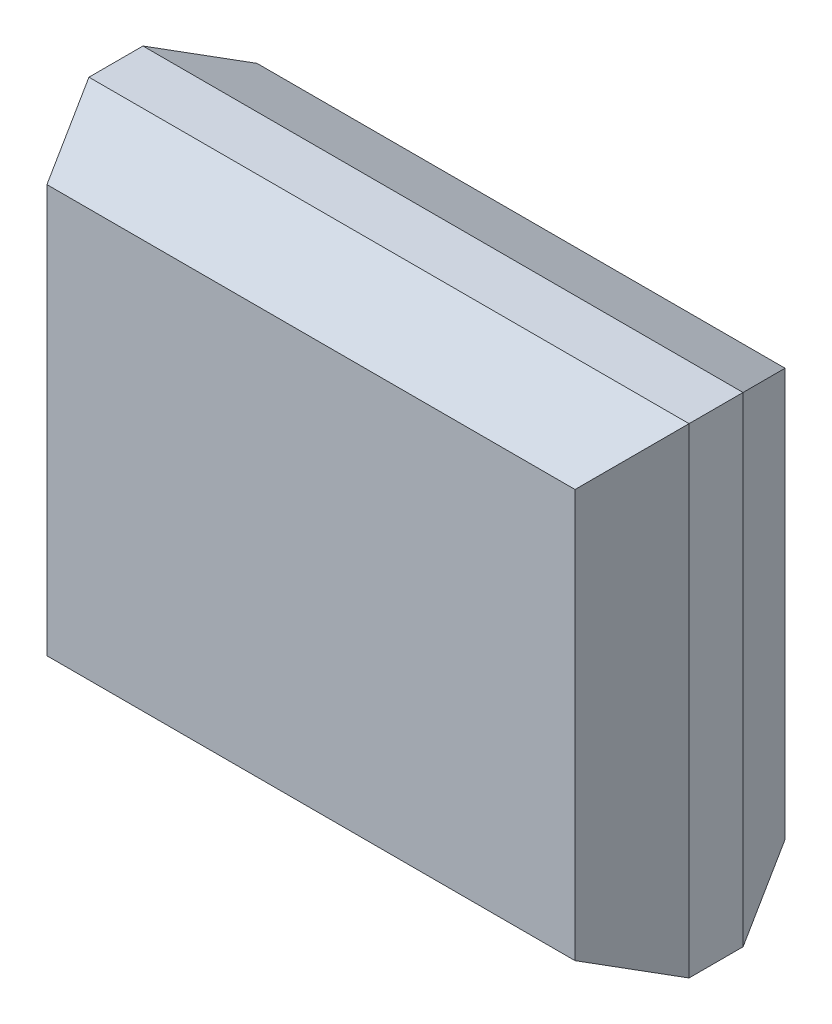
ISO-10303-21;
HEADER;
FILE_DESCRIPTION(('STEP AP214'),'2;1');
FILE_NAME('part.step','',(''),(''),'','','');
FILE_SCHEMA(('AUTOMOTIVE_DESIGN { 1 0 10303 214 1 1 1 1 }'));
ENDSEC;
DATA;
#1=APPLICATION_CONTEXT('core data for automotive mechanical design processes');
#2=APPLICATION_PROTOCOL_DEFINITION('international standard','automotive_design',2000,#1);
#3=PRODUCT_CONTEXT('',#1,'mechanical');
#4=PRODUCT('Part','Part','',(#3));
#5=PRODUCT_RELATED_PRODUCT_CATEGORY('part','',(#4));
#6=PRODUCT_DEFINITION_FORMATION('','',#4);
#7=PRODUCT_DEFINITION_CONTEXT('part definition',#1,'design');
#8=PRODUCT_DEFINITION('design','',#6,#7);
#9=PRODUCT_DEFINITION_SHAPE('','',#8);
#10=(LENGTH_UNIT() NAMED_UNIT(*) SI_UNIT(.MILLI.,.METRE.));
#11=(NAMED_UNIT(*) PLANE_ANGLE_UNIT() SI_UNIT($,.RADIAN.));
#12=(NAMED_UNIT(*) SI_UNIT($,.STERADIAN.) SOLID_ANGLE_UNIT());
#13=UNCERTAINTY_MEASURE_WITH_UNIT(LENGTH_MEASURE(1.E-05),#10,'distance_accuracy_value','');
#14=(GEOMETRIC_REPRESENTATION_CONTEXT(3) GLOBAL_UNCERTAINTY_ASSIGNED_CONTEXT((#13)) GLOBAL_UNIT_ASSIGNED_CONTEXT((#10,
#11,#12)) REPRESENTATION_CONTEXT('',''));
#15=CARTESIAN_POINT('',(0.,0.,0.));
#16=DIRECTION('',(0.,0.,1.));
#17=DIRECTION('',(1.,0.,0.));
#18=AXIS2_PLACEMENT_3D('',#15,#16,#17);
#19=CARTESIAN_POINT('',(0.,0.,1.75));
#20=DIRECTION('',(1.,0.,0.));
#21=DIRECTION('',(0.,0.,-1.));
#22=AXIS2_PLACEMENT_3D('',#19,#20,#21);
#23=PLANE('',#22);
#24=DIRECTION('',(0.,0.,-1.));
#25=VECTOR('',#24,1.);
#26=CARTESIAN_POINT('',(0.,4.,1.75));
#27=LINE('',#26,#25);
#28=CARTESIAN_POINT('',(0.,4.,1.09999999999999));
#29=VERTEX_POINT('',#28);
#30=CARTESIAN_POINT('',(0.,4.,0.650000000000007));
#31=VERTEX_POINT('',#30);
#32=EDGE_CURVE('E173',#29,#31,#27,.T.);
#33=ORIENTED_EDGE('',*,*,#32,.T.);
#34=DIRECTION('',(0.,-1.,0.));
#35=VECTOR('',#34,1.);
#36=CARTESIAN_POINT('',(0.,0.3,0.650000000000005));
#37=LINE('',#36,#35);
#38=CARTESIAN_POINT('',(0.,0.,0.650000000000007));
#39=VERTEX_POINT('',#38);
#40=EDGE_CURVE('E145',#31,#39,#37,.T.);
#41=ORIENTED_EDGE('',*,*,#40,.T.);
#42=DIRECTION('',(0.,0.,-1.));
#43=VECTOR('',#42,1.);
#44=CARTESIAN_POINT('',(0.,0.,1.75));
#45=LINE('',#44,#43);
#46=CARTESIAN_POINT('',(0.,0.,1.1));
#47=VERTEX_POINT('',#46);
#48=EDGE_CURVE('E118',#47,#39,#45,.T.);
#49=ORIENTED_EDGE('',*,*,#48,.F.);
#50=DIRECTION('',(0.,1.,0.));
#51=VECTOR('',#50,1.);
#52=CARTESIAN_POINT('',(0.,0.,1.1));
#53=LINE('',#52,#51);
#54=EDGE_CURVE('E151',#47,#29,#53,.T.);
#55=ORIENTED_EDGE('',*,*,#54,.T.);
#56=EDGE_LOOP('',(#33,#41,#49,#55));
#57=FACE_BOUND('',#56,.T.);
#58=ADVANCED_FACE('F30',(#57),#23,.F.);
#59=CARTESIAN_POINT('',(0.,0.,1.75));
#60=DIRECTION('',(0.,1.,0.));
#61=DIRECTION('',(0.,0.,1.));
#62=AXIS2_PLACEMENT_3D('',#59,#60,#61);
#63=PLANE('',#62);
#64=ORIENTED_EDGE('',*,*,#48,.T.);
#65=DIRECTION('',(1.,0.,0.));
#66=VECTOR('',#65,1.);
#67=CARTESIAN_POINT('',(5.,0.,0.650000000000005));
#68=LINE('',#67,#66);
#69=CARTESIAN_POINT('',(5.,0.,0.650000000000007));
#70=VERTEX_POINT('',#69);
#71=EDGE_CURVE('E117',#39,#70,#68,.T.);
#72=ORIENTED_EDGE('',*,*,#71,.T.);
#73=DIRECTION('',(0.,0.,-1.));
#74=VECTOR('',#73,1.);
#75=CARTESIAN_POINT('',(5.,0.,1.75));
#76=LINE('',#75,#74);
#77=CARTESIAN_POINT('',(5.,0.,1.1));
#78=VERTEX_POINT('',#77);
#79=EDGE_CURVE('E99',#78,#70,#76,.T.);
#80=ORIENTED_EDGE('',*,*,#79,.F.);
#81=DIRECTION('',(-1.,0.,0.));
#82=VECTOR('',#81,1.);
#83=CARTESIAN_POINT('',(0.,0.,1.1));
#84=LINE('',#83,#82);
#85=EDGE_CURVE('E114',#78,#47,#84,.T.);
#86=ORIENTED_EDGE('',*,*,#85,.T.);
#87=EDGE_LOOP('',(#64,#72,#80,#86));
#88=FACE_BOUND('',#87,.T.);
#89=ADVANCED_FACE('F113',(#88),#63,.F.);
#90=CARTESIAN_POINT('',(5.,0.,1.75));
#91=DIRECTION('',(-1.,0.,0.));
#92=DIRECTION('',(0.,0.,1.));
#93=AXIS2_PLACEMENT_3D('',#90,#91,#92);
#94=PLANE('',#93);
#95=ORIENTED_EDGE('',*,*,#79,.T.);
#96=DIRECTION('',(0.,1.,0.));
#97=VECTOR('',#96,1.);
#98=CARTESIAN_POINT('',(5.,3.7,0.650000000000005));
#99=LINE('',#98,#97);
#100=CARTESIAN_POINT('',(5.,4.,0.650000000000007));
#101=VERTEX_POINT('',#100);
#102=EDGE_CURVE('E131',#70,#101,#99,.T.);
#103=ORIENTED_EDGE('',*,*,#102,.T.);
#104=DIRECTION('',(0.,0.,-1.));
#105=VECTOR('',#104,1.);
#106=CARTESIAN_POINT('',(5.,4.,1.75));
#107=LINE('',#106,#105);
#108=CARTESIAN_POINT('',(5.,4.,1.09999999999999));
#109=VERTEX_POINT('',#108);
#110=EDGE_CURVE('E102',#109,#101,#107,.T.);
#111=ORIENTED_EDGE('',*,*,#110,.F.);
#112=DIRECTION('',(0.,-1.,0.));
#113=VECTOR('',#112,1.);
#114=CARTESIAN_POINT('',(5.,0.,1.09999999999999));
#115=LINE('',#114,#113);
#116=EDGE_CURVE('E95',#109,#78,#115,.T.);
#117=ORIENTED_EDGE('',*,*,#116,.T.);
#118=EDGE_LOOP('',(#95,#103,#111,#117));
#119=FACE_BOUND('',#118,.T.);
#120=ADVANCED_FACE('F97',(#119),#94,.F.);
#121=CARTESIAN_POINT('',(0.,4.,1.75));
#122=DIRECTION('',(0.,-1.,0.));
#123=DIRECTION('',(0.,0.,-1.));
#124=AXIS2_PLACEMENT_3D('',#121,#122,#123);
#125=PLANE('',#124);
#126=ORIENTED_EDGE('',*,*,#110,.T.);
#127=DIRECTION('',(-1.,0.,0.));
#128=VECTOR('',#127,1.);
#129=CARTESIAN_POINT('',(0.,4.,0.650000000000005));
#130=LINE('',#129,#128);
#131=EDGE_CURVE('E159',#101,#31,#130,.T.);
#132=ORIENTED_EDGE('',*,*,#131,.T.);
#133=ORIENTED_EDGE('',*,*,#32,.F.);
#134=DIRECTION('',(1.,0.,0.));
#135=VECTOR('',#134,1.);
#136=CARTESIAN_POINT('',(0.,4.,1.09999999999999));
#137=LINE('',#136,#135);
#138=EDGE_CURVE('E162',#29,#109,#137,.T.);
#139=ORIENTED_EDGE('',*,*,#138,.T.);
#140=EDGE_LOOP('',(#126,#132,#133,#139));
#141=FACE_BOUND('',#140,.T.);
#142=ADVANCED_FACE('F189',(#141),#125,.F.);
#143=CARTESIAN_POINT('',(0.,4.,1.75));
#144=DIRECTION('',(0.,0.,-1.));
#145=DIRECTION('',(-1.,0.,0.));
#146=AXIS2_PLACEMENT_3D('',#143,#144,#145);
#147=PLANE('',#146);
#148=DIRECTION('',(1.,0.,0.));
#149=VECTOR('',#148,1.);
#150=CARTESIAN_POINT('',(0.,0.3,1.75));
#151=LINE('',#150,#149);
#152=CARTESIAN_POINT('',(0.3,0.3,1.75));
#153=VERTEX_POINT('',#152);
#154=CARTESIAN_POINT('',(4.7,0.3,1.75));
#155=VERTEX_POINT('',#154);
#156=EDGE_CURVE('E125',#153,#155,#151,.T.);
#157=ORIENTED_EDGE('',*,*,#156,.T.);
#158=DIRECTION('',(0.,1.,0.));
#159=VECTOR('',#158,1.);
#160=CARTESIAN_POINT('',(4.7,4.,1.75));
#161=LINE('',#160,#159);
#162=CARTESIAN_POINT('',(4.7,3.7,1.75));
#163=VERTEX_POINT('',#162);
#164=EDGE_CURVE('E130',#155,#163,#161,.T.);
#165=ORIENTED_EDGE('',*,*,#164,.T.);
#166=DIRECTION('',(-1.,0.,0.));
#167=VECTOR('',#166,1.);
#168=CARTESIAN_POINT('',(0.,3.7,1.75));
#169=LINE('',#168,#167);
#170=CARTESIAN_POINT('',(0.3,3.7,1.75));
#171=VERTEX_POINT('',#170);
#172=EDGE_CURVE('E165',#163,#171,#169,.T.);
#173=ORIENTED_EDGE('',*,*,#172,.T.);
#174=DIRECTION('',(0.,-1.,0.));
#175=VECTOR('',#174,1.);
#176=CARTESIAN_POINT('',(0.3,4.,1.75));
#177=LINE('',#176,#175);
#178=EDGE_CURVE('E154',#171,#153,#177,.T.);
#179=ORIENTED_EDGE('',*,*,#178,.T.);
#180=EDGE_LOOP('',(#157,#165,#173,#179));
#181=FACE_BOUND('',#180,.T.);
#182=ADVANCED_FACE('F193',(#181),#147,.F.);
#183=CARTESIAN_POINT('',(0.,4.,0.));
#184=DIRECTION('',(0.,0.,-1.));
#185=DIRECTION('',(-1.,0.,0.));
#186=AXIS2_PLACEMENT_3D('',#183,#184,#185);
#187=PLANE('',#186);
#188=DIRECTION('',(1.,0.,0.));
#189=VECTOR('',#188,1.);
#190=CARTESIAN_POINT('',(5.,3.7,0.));
#191=LINE('',#190,#189);
#192=CARTESIAN_POINT('',(0.300000000000001,3.7,0.));
#193=VERTEX_POINT('',#192);
#194=CARTESIAN_POINT('',(4.7,3.7,0.));
#195=VERTEX_POINT('',#194);
#196=EDGE_CURVE('E157',#193,#195,#191,.T.);
#197=ORIENTED_EDGE('',*,*,#196,.T.);
#198=DIRECTION('',(0.,-1.,0.));
#199=VECTOR('',#198,1.);
#200=CARTESIAN_POINT('',(4.7,0.3,0.));
#201=LINE('',#200,#199);
#202=CARTESIAN_POINT('',(4.7,0.3,0.));
#203=VERTEX_POINT('',#202);
#204=EDGE_CURVE('E38',#195,#203,#201,.T.);
#205=ORIENTED_EDGE('',*,*,#204,.T.);
#206=DIRECTION('',(-1.,0.,0.));
#207=VECTOR('',#206,1.);
#208=CARTESIAN_POINT('',(0.,0.3,0.));
#209=LINE('',#208,#207);
#210=CARTESIAN_POINT('',(0.3,0.3,0.));
#211=VERTEX_POINT('',#210);
#212=EDGE_CURVE('E167',#203,#211,#209,.T.);
#213=ORIENTED_EDGE('',*,*,#212,.T.);
#214=DIRECTION('',(0.,1.,0.));
#215=VECTOR('',#214,1.);
#216=CARTESIAN_POINT('',(0.3,3.7,0.));
#217=LINE('',#216,#215);
#218=EDGE_CURVE('E140',#211,#193,#217,.T.);
#219=ORIENTED_EDGE('',*,*,#218,.T.);
#220=EDGE_LOOP('',(#197,#205,#213,#219));
#221=FACE_BOUND('',#220,.T.);
#222=ADVANCED_FACE('F191',(#221),#187,.T.);
#223=CARTESIAN_POINT('',(0.,0.3,1.75));
#224=DIRECTION('',(0.,0.907959384500453,-0.419058177461745));
#225=DIRECTION('',(0.,0.419058177461745,0.907959384500453));
#226=AXIS2_PLACEMENT_3D('',#223,#224,#225);
#227=PLANE('',#226);
#228=ORIENTED_EDGE('',*,*,#85,.F.);
#229=DIRECTION('',(-0.386493975840497,0.386493975840497,0.837403614321082));
#230=VECTOR('',#229,1.);
#231=CARTESIAN_POINT('',(3.99792531120332,1.00207468879667,3.27116182572614));
#232=LINE('',#231,#230);
#233=EDGE_CURVE('E105',#78,#155,#232,.T.);
#234=ORIENTED_EDGE('',*,*,#233,.T.);
#235=ORIENTED_EDGE('',*,*,#156,.F.);
#236=DIRECTION('',(-0.386493975840497,-0.386493975840497,-0.837403614321082));
#237=VECTOR('',#236,1.);
#238=CARTESIAN_POINT('',(0.255186721991702,0.255186721991702,1.65290456431535));
#239=LINE('',#238,#237);
#240=EDGE_CURVE('E124',#153,#47,#239,.T.);
#241=ORIENTED_EDGE('',*,*,#240,.T.);
#242=EDGE_LOOP('',(#228,#234,#235,#241));
#243=FACE_BOUND('',#242,.T.);
#244=ADVANCED_FACE('F121',(#243),#227,.F.);
#245=CARTESIAN_POINT('',(0.,0.,0.650000000000005));
#246=DIRECTION('',(0.,-0.907959384500453,-0.419058177461745));
#247=DIRECTION('',(0.,0.419058177461745,-0.907959384500453));
#248=AXIS2_PLACEMENT_3D('',#245,#246,#247);
#249=PLANE('',#248);
#250=ORIENTED_EDGE('',*,*,#212,.F.);
#251=DIRECTION('',(0.386493975840497,-0.386493975840497,0.837403614321082));
#252=VECTOR('',#251,1.);
#253=CARTESIAN_POINT('',(4.25311203319503,0.746887966804974,-0.968257261410782));
#254=LINE('',#253,#252);
#255=EDGE_CURVE('E11',#203,#70,#254,.T.);
#256=ORIENTED_EDGE('',*,*,#255,.T.);
#257=ORIENTED_EDGE('',*,*,#71,.F.);
#258=DIRECTION('',(0.386493975840497,0.386493975840497,-0.837403614321082));
#259=VECTOR('',#258,1.);
#260=CARTESIAN_POINT('',(0.,0.,0.650000000000005));
#261=LINE('',#260,#259);
#262=EDGE_CURVE('E142',#39,#211,#261,.T.);
#263=ORIENTED_EDGE('',*,*,#262,.T.);
#264=EDGE_LOOP('',(#250,#256,#257,#263));
#265=FACE_BOUND('',#264,.T.);
#266=ADVANCED_FACE('F186',(#265),#249,.T.);
#267=CARTESIAN_POINT('',(0.,3.7,1.75));
#268=DIRECTION('',(0.,-0.907959384500452,-0.419058177461745));
#269=DIRECTION('',(0.,0.419058177461745,-0.907959384500453));
#270=AXIS2_PLACEMENT_3D('',#267,#268,#269);
#271=PLANE('',#270);
#272=ORIENTED_EDGE('',*,*,#172,.F.);
#273=DIRECTION('',(0.386493975840497,0.386493975840497,-0.837403614321082));
#274=VECTOR('',#273,1.);
#275=CARTESIAN_POINT('',(3.99792531120332,2.99792531120332,3.27116182572614));
#276=LINE('',#275,#274);
#277=EDGE_CURVE('E106',#163,#109,#276,.T.);
#278=ORIENTED_EDGE('',*,*,#277,.T.);
#279=ORIENTED_EDGE('',*,*,#138,.F.);
#280=DIRECTION('',(0.386493975840497,-0.386493975840497,0.837403614321082));
#281=VECTOR('',#280,1.);
#282=CARTESIAN_POINT('',(0.255186721991702,3.7448132780083,1.65290456431535));
#283=LINE('',#282,#281);
#284=EDGE_CURVE('E148',#29,#171,#283,.T.);
#285=ORIENTED_EDGE('',*,*,#284,.T.);
#286=EDGE_LOOP('',(#272,#278,#279,#285));
#287=FACE_BOUND('',#286,.T.);
#288=ADVANCED_FACE('F213',(#287),#271,.F.);
#289=CARTESIAN_POINT('',(0.,4.,0.650000000000005));
#290=DIRECTION('',(0.,0.907959384500453,-0.419058177461745));
#291=DIRECTION('',(0.,0.419058177461745,0.907959384500453));
#292=AXIS2_PLACEMENT_3D('',#289,#290,#291);
#293=PLANE('',#292);
#294=ORIENTED_EDGE('',*,*,#131,.F.);
#295=DIRECTION('',(-0.386493975840497,-0.386493975840497,-0.837403614321082));
#296=VECTOR('',#295,1.);
#297=CARTESIAN_POINT('',(4.25311203319503,3.25311203319503,-0.968257261410782));
#298=LINE('',#297,#296);
#299=EDGE_CURVE('E52',#101,#195,#298,.T.);
#300=ORIENTED_EDGE('',*,*,#299,.T.);
#301=ORIENTED_EDGE('',*,*,#196,.F.);
#302=DIRECTION('',(-0.386493975840497,0.386493975840497,0.837403614321082));
#303=VECTOR('',#302,1.);
#304=CARTESIAN_POINT('',(0.,4.,0.650000000000005));
#305=LINE('',#304,#303);
#306=EDGE_CURVE('E138',#193,#31,#305,.T.);
#307=ORIENTED_EDGE('',*,*,#306,.T.);
#308=EDGE_LOOP('',(#294,#300,#301,#307));
#309=FACE_BOUND('',#308,.T.);
#310=ADVANCED_FACE('F190',(#309),#293,.T.);
#311=CARTESIAN_POINT('',(0.3,4.,1.75));
#312=DIRECTION('',(0.907959384500453,0.,-0.419058177461745));
#313=DIRECTION('',(-0.419058177461745,0.,-0.907959384500453));
#314=AXIS2_PLACEMENT_3D('',#311,#312,#313);
#315=PLANE('',#314);
#316=ORIENTED_EDGE('',*,*,#284,.F.);
#317=ORIENTED_EDGE('',*,*,#54,.F.);
#318=ORIENTED_EDGE('',*,*,#240,.F.);
#319=ORIENTED_EDGE('',*,*,#178,.F.);
#320=EDGE_LOOP('',(#316,#317,#318,#319));
#321=FACE_BOUND('',#320,.T.);
#322=ADVANCED_FACE('F219',(#321),#315,.F.);
#323=CARTESIAN_POINT('',(0.,0.,0.650000000000005));
#324=DIRECTION('',(-0.907959384500453,0.,-0.419058177461745));
#325=DIRECTION('',(-0.419058177461745,0.,0.907959384500453));
#326=AXIS2_PLACEMENT_3D('',#323,#324,#325);
#327=PLANE('',#326);
#328=ORIENTED_EDGE('',*,*,#306,.F.);
#329=ORIENTED_EDGE('',*,*,#218,.F.);
#330=ORIENTED_EDGE('',*,*,#262,.F.);
#331=ORIENTED_EDGE('',*,*,#40,.F.);
#332=EDGE_LOOP('',(#328,#329,#330,#331));
#333=FACE_BOUND('',#332,.T.);
#334=ADVANCED_FACE('F183',(#333),#327,.T.);
#335=CARTESIAN_POINT('',(4.7,4.,1.75));
#336=DIRECTION('',(-0.907959384500452,0.,-0.419058177461745));
#337=DIRECTION('',(-0.419058177461745,0.,0.907959384500453));
#338=AXIS2_PLACEMENT_3D('',#335,#336,#337);
#339=PLANE('',#338);
#340=ORIENTED_EDGE('',*,*,#233,.F.);
#341=ORIENTED_EDGE('',*,*,#116,.F.);
#342=ORIENTED_EDGE('',*,*,#277,.F.);
#343=ORIENTED_EDGE('',*,*,#164,.F.);
#344=EDGE_LOOP('',(#340,#341,#342,#343));
#345=FACE_BOUND('',#344,.T.);
#346=ADVANCED_FACE('F128',(#345),#339,.F.);
#347=CARTESIAN_POINT('',(5.,0.,0.650000000000005));
#348=DIRECTION('',(0.907959384500452,0.,-0.419058177461745));
#349=DIRECTION('',(-0.419058177461745,0.,-0.907959384500452));
#350=AXIS2_PLACEMENT_3D('',#347,#348,#349);
#351=PLANE('',#350);
#352=ORIENTED_EDGE('',*,*,#255,.F.);
#353=ORIENTED_EDGE('',*,*,#204,.F.);
#354=ORIENTED_EDGE('',*,*,#299,.F.);
#355=ORIENTED_EDGE('',*,*,#102,.F.);
#356=EDGE_LOOP('',(#352,#353,#354,#355));
#357=FACE_BOUND('',#356,.T.);
#358=ADVANCED_FACE('F32',(#357),#351,.T.);
#359=CLOSED_SHELL('',(#58,#89,#120,#142,#182,#222,#244,#266,#288,#310,#322,#334,#346,#358));
#360=MANIFOLD_SOLID_BREP('B2',#359);
#361=ADVANCED_BREP_SHAPE_REPRESENTATION('',(#18,#360),#14);
#362=SHAPE_DEFINITION_REPRESENTATION(#9,#361);
ENDSEC;
END-ISO-10303-21;
